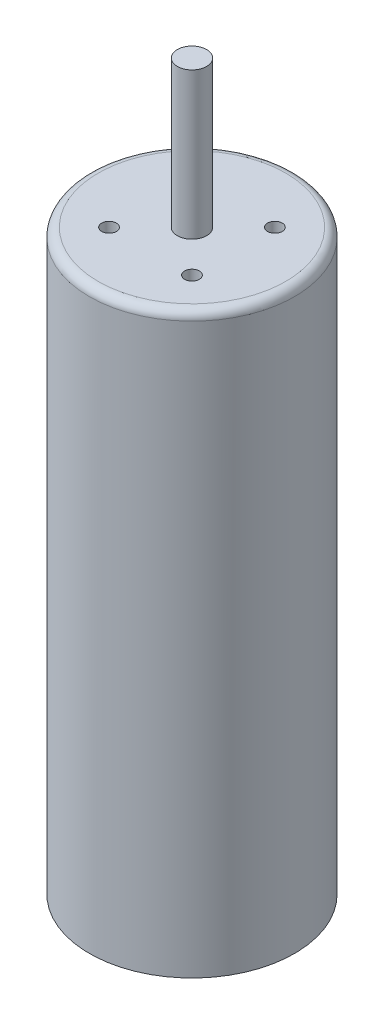
ISO-10303-21;
HEADER;
FILE_DESCRIPTION(('STEP AP214'),'2;1');
FILE_NAME('part.step','',(''),(''),'','','');
FILE_SCHEMA(('AUTOMOTIVE_DESIGN { 1 0 10303 214 1 1 1 1 }'));
ENDSEC;
DATA;
#1=APPLICATION_CONTEXT('core data for automotive mechanical design processes');
#2=APPLICATION_PROTOCOL_DEFINITION('international standard','automotive_design',2000,#1);
#3=PRODUCT_CONTEXT('',#1,'mechanical');
#4=PRODUCT('Part','Part','',(#3));
#5=PRODUCT_RELATED_PRODUCT_CATEGORY('part','',(#4));
#6=PRODUCT_DEFINITION_FORMATION('','',#4);
#7=PRODUCT_DEFINITION_CONTEXT('part definition',#1,'design');
#8=PRODUCT_DEFINITION('design','',#6,#7);
#9=PRODUCT_DEFINITION_SHAPE('','',#8);
#10=(LENGTH_UNIT() NAMED_UNIT(*) SI_UNIT(.MILLI.,.METRE.));
#11=(NAMED_UNIT(*) PLANE_ANGLE_UNIT() SI_UNIT($,.RADIAN.));
#12=(NAMED_UNIT(*) SI_UNIT($,.STERADIAN.) SOLID_ANGLE_UNIT());
#13=UNCERTAINTY_MEASURE_WITH_UNIT(LENGTH_MEASURE(1.E-05),#10,'distance_accuracy_value','');
#14=(GEOMETRIC_REPRESENTATION_CONTEXT(3) GLOBAL_UNCERTAINTY_ASSIGNED_CONTEXT((#13)) GLOBAL_UNIT_ASSIGNED_CONTEXT((#10,
#11,#12)) REPRESENTATION_CONTEXT('',''));
#15=CARTESIAN_POINT('',(0.,0.,0.));
#16=DIRECTION('',(0.,0.,1.));
#17=DIRECTION('',(1.,0.,0.));
#18=AXIS2_PLACEMENT_3D('',#15,#16,#17);
#19=CARTESIAN_POINT('',(0.,20.,0.));
#20=DIRECTION('',(0.,-1.,0.));
#21=DIRECTION('',(0.,0.,-1.));
#22=AXIS2_PLACEMENT_3D('',#19,#20,#21);
#23=CYLINDRICAL_SURFACE('',#22,3.5);
#24=CARTESIAN_POINT('',(0.,19.7,0.));
#25=DIRECTION('',(0.,1.,0.));
#26=DIRECTION('',(0.,0.,1.));
#27=AXIS2_PLACEMENT_3D('',#24,#25,#26);
#28=CIRCLE('',#27,3.5);
#29=CARTESIAN_POINT('',(0.,19.7,3.5));
#30=VERTEX_POINT('',#29);
#31=EDGE_CURVE('E11',#30,#30,#28,.F.);
#32=ORIENTED_EDGE('',*,*,#31,.T.);
#33=EDGE_LOOP('',(#32));
#34=FACE_BOUND('',#33,.T.);
#35=CARTESIAN_POINT('',(0.,0.300000000000002,0.));
#36=DIRECTION('',(0.,-1.,0.));
#37=DIRECTION('',(0.,0.,-1.));
#38=AXIS2_PLACEMENT_3D('',#35,#36,#37);
#39=CIRCLE('',#38,3.5);
#40=CARTESIAN_POINT('',(0.,0.300000000000002,-3.5));
#41=VERTEX_POINT('',#40);
#42=EDGE_CURVE('E38',#41,#41,#39,.T.);
#43=ORIENTED_EDGE('',*,*,#42,.F.);
#44=EDGE_LOOP('',(#43));
#45=FACE_BOUND('',#44,.T.);
#46=ADVANCED_FACE('F34',(#34,#45),#23,.T.);
#47=CARTESIAN_POINT('',(0.,20.,0.));
#48=DIRECTION('',(0.,1.,0.));
#49=DIRECTION('',(0.,0.,1.));
#50=AXIS2_PLACEMENT_3D('',#47,#48,#49);
#51=PLANE('',#50);
#52=CARTESIAN_POINT('',(-1.41421356237301,20.,1.4142135623731));
#53=DIRECTION('',(0.,1.,0.));
#54=DIRECTION('',(0.,0.,1.));
#55=AXIS2_PLACEMENT_3D('',#52,#53,#54);
#56=CIRCLE('',#55,0.250000000000041);
#57=CARTESIAN_POINT('',(-1.41421356237301,20.,1.66421356237314));
#58=VERTEX_POINT('',#57);
#59=EDGE_CURVE('E61',#58,#58,#56,.T.);
#60=ORIENTED_EDGE('',*,*,#59,.F.);
#61=EDGE_LOOP('',(#60));
#62=FACE_BOUND('',#61,.T.);
#63=CARTESIAN_POINT('',(1.41421356237318,20.,1.41421356237301));
#64=DIRECTION('',(0.,1.,0.));
#65=DIRECTION('',(0.,0.,1.));
#66=AXIS2_PLACEMENT_3D('',#63,#64,#65);
#67=CIRCLE('',#66,0.250000000000111);
#68=CARTESIAN_POINT('',(1.41421356237318,20.,1.66421356237312));
#69=VERTEX_POINT('',#68);
#70=EDGE_CURVE('E67',#69,#69,#67,.T.);
#71=ORIENTED_EDGE('',*,*,#70,.F.);
#72=EDGE_LOOP('',(#71));
#73=FACE_BOUND('',#72,.T.);
#74=CARTESIAN_POINT('',(1.41421356237309,20.,-1.41421356237318));
#75=DIRECTION('',(0.,1.,0.));
#76=DIRECTION('',(0.,0.,1.));
#77=AXIS2_PLACEMENT_3D('',#74,#75,#76);
#78=CIRCLE('',#77,0.250000000000081);
#79=CARTESIAN_POINT('',(1.41421356237309,20.,-1.1642135623731));
#80=VERTEX_POINT('',#79);
#81=EDGE_CURVE('E73',#80,#80,#78,.T.);
#82=ORIENTED_EDGE('',*,*,#81,.F.);
#83=EDGE_LOOP('',(#82));
#84=FACE_BOUND('',#83,.T.);
#85=CARTESIAN_POINT('',(-1.4142135623731,20.,-1.41421356237309));
#86=DIRECTION('',(0.,1.,0.));
#87=DIRECTION('',(0.,0.,1.));
#88=AXIS2_PLACEMENT_3D('',#85,#86,#87);
#89=CIRCLE('',#88,0.25);
#90=CARTESIAN_POINT('',(-1.4142135623731,20.,-1.16421356237309));
#91=VERTEX_POINT('',#90);
#92=EDGE_CURVE('E55',#91,#91,#89,.T.);
#93=ORIENTED_EDGE('',*,*,#92,.F.);
#94=EDGE_LOOP('',(#93));
#95=FACE_BOUND('',#94,.T.);
#96=CARTESIAN_POINT('',(0.,20.,0.));
#97=DIRECTION('',(0.,1.,0.));
#98=DIRECTION('',(0.,0.,1.));
#99=AXIS2_PLACEMENT_3D('',#96,#97,#98);
#100=CIRCLE('',#99,3.2);
#101=CARTESIAN_POINT('',(0.,20.,3.2));
#102=VERTEX_POINT('',#101);
#103=EDGE_CURVE('E42',#102,#102,#100,.T.);
#104=ORIENTED_EDGE('',*,*,#103,.T.);
#105=EDGE_LOOP('',(#104));
#106=FACE_BOUND('',#105,.T.);
#107=CARTESIAN_POINT('',(0.,20.,0.));
#108=DIRECTION('',(0.,1.,0.));
#109=DIRECTION('',(0.,0.,1.));
#110=AXIS2_PLACEMENT_3D('',#107,#108,#109);
#111=CIRCLE('',#110,0.5);
#112=CARTESIAN_POINT('',(0.,20.,0.5));
#113=VERTEX_POINT('',#112);
#114=EDGE_CURVE('E49',#113,#113,#111,.T.);
#115=ORIENTED_EDGE('',*,*,#114,.F.);
#116=EDGE_LOOP('',(#115));
#117=FACE_BOUND('',#116,.T.);
#118=ADVANCED_FACE('F117',(#62,#73,#84,#95,#106,#117),#51,.T.);
#119=CARTESIAN_POINT('',(0.,25.,0.));
#120=DIRECTION('',(0.,-1.,0.));
#121=DIRECTION('',(0.,0.,-1.));
#122=AXIS2_PLACEMENT_3D('',#119,#120,#121);
#123=CYLINDRICAL_SURFACE('',#122,0.5);
#124=CARTESIAN_POINT('',(0.,25.,0.));
#125=DIRECTION('',(0.,1.,0.));
#126=DIRECTION('',(0.,0.,1.));
#127=AXIS2_PLACEMENT_3D('',#124,#125,#126);
#128=CIRCLE('',#127,0.5);
#129=CARTESIAN_POINT('',(0.,25.,0.5));
#130=VERTEX_POINT('',#129);
#131=EDGE_CURVE('E46',#130,#130,#128,.T.);
#132=ORIENTED_EDGE('',*,*,#131,.F.);
#133=EDGE_LOOP('',(#132));
#134=FACE_BOUND('',#133,.T.);
#135=ORIENTED_EDGE('',*,*,#114,.T.);
#136=EDGE_LOOP('',(#135));
#137=FACE_BOUND('',#136,.T.);
#138=ADVANCED_FACE('F123',(#134,#137),#123,.T.);
#139=CARTESIAN_POINT('',(0.,25.,0.));
#140=DIRECTION('',(0.,1.,0.));
#141=DIRECTION('',(0.,0.,1.));
#142=AXIS2_PLACEMENT_3D('',#139,#140,#141);
#143=PLANE('',#142);
#144=ORIENTED_EDGE('',*,*,#131,.T.);
#145=EDGE_LOOP('',(#144));
#146=FACE_BOUND('',#145,.T.);
#147=ADVANCED_FACE('F130',(#146),#143,.T.);
#148=CARTESIAN_POINT('',(0.,19.7,0.));
#149=DIRECTION('',(0.,1.,0.));
#150=DIRECTION('',(0.,0.,1.));
#151=AXIS2_PLACEMENT_3D('',#148,#149,#150);
#152=TOROIDAL_SURFACE('',#151,3.2,0.3);
#153=ORIENTED_EDGE('',*,*,#31,.F.);
#154=EDGE_LOOP('',(#153));
#155=FACE_BOUND('',#154,.T.);
#156=ORIENTED_EDGE('',*,*,#103,.F.);
#157=EDGE_LOOP('',(#156));
#158=FACE_BOUND('',#157,.T.);
#159=ADVANCED_FACE('F36',(#155,#158),#152,.T.);
#160=CARTESIAN_POINT('',(-1.4142135623731,15.,-1.41421356237309));
#161=DIRECTION('',(0.,1.,0.));
#162=DIRECTION('',(0.,0.,1.));
#163=AXIS2_PLACEMENT_3D('',#160,#161,#162);
#164=CYLINDRICAL_SURFACE('',#163,0.25);
#165=CARTESIAN_POINT('',(-1.4142135623731,15.,-1.41421356237309));
#166=DIRECTION('',(0.,1.,0.));
#167=DIRECTION('',(0.,0.,1.));
#168=AXIS2_PLACEMENT_3D('',#165,#166,#167);
#169=CIRCLE('',#168,0.25);
#170=CARTESIAN_POINT('',(-1.4142135623731,15.,-1.16421356237309));
#171=VERTEX_POINT('',#170);
#172=EDGE_CURVE('E52',#171,#171,#169,.T.);
#173=ORIENTED_EDGE('',*,*,#172,.F.);
#174=EDGE_LOOP('',(#173));
#175=FACE_BOUND('',#174,.T.);
#176=ORIENTED_EDGE('',*,*,#92,.T.);
#177=EDGE_LOOP('',(#176));
#178=FACE_BOUND('',#177,.T.);
#179=ADVANCED_FACE('F135',(#175,#178),#164,.F.);
#180=CARTESIAN_POINT('',(-1.4142135623731,15.,-1.41421356237309));
#181=DIRECTION('',(0.,1.,0.));
#182=DIRECTION('',(0.,0.,1.));
#183=AXIS2_PLACEMENT_3D('',#180,#181,#182);
#184=PLANE('',#183);
#185=ORIENTED_EDGE('',*,*,#172,.T.);
#186=EDGE_LOOP('',(#185));
#187=FACE_BOUND('',#186,.T.);
#188=ADVANCED_FACE('F138',(#187),#184,.T.);
#189=CARTESIAN_POINT('',(1.41421356237309,15.,-1.41421356237318));
#190=DIRECTION('',(0.,1.,0.));
#191=DIRECTION('',(0.,0.,1.));
#192=AXIS2_PLACEMENT_3D('',#189,#190,#191);
#193=CYLINDRICAL_SURFACE('',#192,0.250000000000081);
#194=CARTESIAN_POINT('',(1.41421356237309,15.,-1.41421356237318));
#195=DIRECTION('',(0.,1.,0.));
#196=DIRECTION('',(0.,0.,1.));
#197=AXIS2_PLACEMENT_3D('',#194,#195,#196);
#198=CIRCLE('',#197,0.250000000000081);
#199=CARTESIAN_POINT('',(1.41421356237309,15.,-1.1642135623731));
#200=VERTEX_POINT('',#199);
#201=EDGE_CURVE('E58',#200,#200,#198,.T.);
#202=ORIENTED_EDGE('',*,*,#201,.F.);
#203=EDGE_LOOP('',(#202));
#204=FACE_BOUND('',#203,.T.);
#205=ORIENTED_EDGE('',*,*,#81,.T.);
#206=EDGE_LOOP('',(#205));
#207=FACE_BOUND('',#206,.T.);
#208=ADVANCED_FACE('F142',(#204,#207),#193,.F.);
#209=CARTESIAN_POINT('',(1.41421356237309,15.,-1.41421356237318));
#210=DIRECTION('',(0.,1.,0.));
#211=DIRECTION('',(0.,0.,1.));
#212=AXIS2_PLACEMENT_3D('',#209,#210,#211);
#213=PLANE('',#212);
#214=ORIENTED_EDGE('',*,*,#201,.T.);
#215=EDGE_LOOP('',(#214));
#216=FACE_BOUND('',#215,.T.);
#217=ADVANCED_FACE('F155',(#216),#213,.T.);
#218=CARTESIAN_POINT('',(1.41421356237318,15.,1.41421356237301));
#219=DIRECTION('',(0.,1.,0.));
#220=DIRECTION('',(0.,0.,1.));
#221=AXIS2_PLACEMENT_3D('',#218,#219,#220);
#222=CYLINDRICAL_SURFACE('',#221,0.250000000000111);
#223=CARTESIAN_POINT('',(1.41421356237318,15.,1.41421356237301));
#224=DIRECTION('',(0.,1.,0.));
#225=DIRECTION('',(0.,0.,1.));
#226=AXIS2_PLACEMENT_3D('',#223,#224,#225);
#227=CIRCLE('',#226,0.250000000000111);
#228=CARTESIAN_POINT('',(1.41421356237318,15.,1.66421356237312));
#229=VERTEX_POINT('',#228);
#230=EDGE_CURVE('E70',#229,#229,#227,.T.);
#231=ORIENTED_EDGE('',*,*,#230,.F.);
#232=EDGE_LOOP('',(#231));
#233=FACE_BOUND('',#232,.T.);
#234=ORIENTED_EDGE('',*,*,#70,.T.);
#235=EDGE_LOOP('',(#234));
#236=FACE_BOUND('',#235,.T.);
#237=ADVANCED_FACE('F152',(#233,#236),#222,.F.);
#238=CARTESIAN_POINT('',(1.41421356237318,15.,1.41421356237301));
#239=DIRECTION('',(0.,1.,0.));
#240=DIRECTION('',(0.,0.,1.));
#241=AXIS2_PLACEMENT_3D('',#238,#239,#240);
#242=PLANE('',#241);
#243=ORIENTED_EDGE('',*,*,#230,.T.);
#244=EDGE_LOOP('',(#243));
#245=FACE_BOUND('',#244,.T.);
#246=ADVANCED_FACE('F147',(#245),#242,.T.);
#247=CARTESIAN_POINT('',(-1.41421356237301,15.,1.4142135623731));
#248=DIRECTION('',(0.,1.,0.));
#249=DIRECTION('',(0.,0.,1.));
#250=AXIS2_PLACEMENT_3D('',#247,#248,#249);
#251=CYLINDRICAL_SURFACE('',#250,0.250000000000041);
#252=CARTESIAN_POINT('',(-1.41421356237301,15.,1.4142135623731));
#253=DIRECTION('',(0.,1.,0.));
#254=DIRECTION('',(0.,0.,1.));
#255=AXIS2_PLACEMENT_3D('',#252,#253,#254);
#256=CIRCLE('',#255,0.250000000000041);
#257=CARTESIAN_POINT('',(-1.41421356237301,15.,1.66421356237314));
#258=VERTEX_POINT('',#257);
#259=EDGE_CURVE('E64',#258,#258,#256,.T.);
#260=ORIENTED_EDGE('',*,*,#259,.F.);
#261=EDGE_LOOP('',(#260));
#262=FACE_BOUND('',#261,.T.);
#263=ORIENTED_EDGE('',*,*,#59,.T.);
#264=EDGE_LOOP('',(#263));
#265=FACE_BOUND('',#264,.T.);
#266=ADVANCED_FACE('F144',(#262,#265),#251,.F.);
#267=CARTESIAN_POINT('',(-1.41421356237301,15.,1.4142135623731));
#268=DIRECTION('',(0.,1.,0.));
#269=DIRECTION('',(0.,0.,1.));
#270=AXIS2_PLACEMENT_3D('',#267,#268,#269);
#271=PLANE('',#270);
#272=ORIENTED_EDGE('',*,*,#259,.T.);
#273=EDGE_LOOP('',(#272));
#274=FACE_BOUND('',#273,.T.);
#275=ADVANCED_FACE('F113',(#274),#271,.T.);
#276=CARTESIAN_POINT('',(0.,0.3,0.));
#277=DIRECTION('',(0.,-1.,0.));
#278=DIRECTION('',(0.,0.,-1.));
#279=AXIS2_PLACEMENT_3D('',#276,#277,#278);
#280=PLANE('',#279);
#281=CARTESIAN_POINT('',(0.,0.3,0.));
#282=DIRECTION('',(0.,-1.,0.));
#283=DIRECTION('',(0.,0.,-1.));
#284=AXIS2_PLACEMENT_3D('',#281,#282,#283);
#285=CIRCLE('',#284,3.);
#286=CARTESIAN_POINT('',(0.,0.3,-3.));
#287=VERTEX_POINT('',#286);
#288=EDGE_CURVE('E81',#287,#287,#285,.T.);
#289=ORIENTED_EDGE('',*,*,#288,.F.);
#290=EDGE_LOOP('',(#289));
#291=FACE_BOUND('',#290,.T.);
#292=ORIENTED_EDGE('',*,*,#42,.T.);
#293=EDGE_LOOP('',(#292));
#294=FACE_BOUND('',#293,.T.);
#295=ADVANCED_FACE('F107',(#291,#294),#280,.T.);
#296=CARTESIAN_POINT('',(0.,0.3,0.));
#297=DIRECTION('',(0.,-1.,0.));
#298=DIRECTION('',(0.,0.,-1.));
#299=AXIS2_PLACEMENT_3D('',#296,#297,#298);
#300=CYLINDRICAL_SURFACE('',#299,3.);
#301=ORIENTED_EDGE('',*,*,#288,.T.);
#302=EDGE_LOOP('',(#301));
#303=FACE_BOUND('',#302,.T.);
#304=CARTESIAN_POINT('',(0.,0.,0.));
#305=DIRECTION('',(0.,-1.,0.));
#306=DIRECTION('',(0.,0.,-1.));
#307=AXIS2_PLACEMENT_3D('',#304,#305,#306);
#308=CIRCLE('',#307,3.);
#309=CARTESIAN_POINT('',(0.,0.,-3.));
#310=VERTEX_POINT('',#309);
#311=EDGE_CURVE('E78',#310,#310,#308,.T.);
#312=ORIENTED_EDGE('',*,*,#311,.F.);
#313=EDGE_LOOP('',(#312));
#314=FACE_BOUND('',#313,.T.);
#315=ADVANCED_FACE('F102',(#303,#314),#300,.T.);
#316=CARTESIAN_POINT('',(0.,0.,0.));
#317=DIRECTION('',(0.,1.,0.));
#318=DIRECTION('',(0.,0.,1.));
#319=AXIS2_PLACEMENT_3D('',#316,#317,#318);
#320=PLANE('',#319);
#321=CARTESIAN_POINT('',(0.,0.,0.));
#322=DIRECTION('',(0.,-1.,0.));
#323=DIRECTION('',(0.,0.,-1.));
#324=AXIS2_PLACEMENT_3D('',#321,#322,#323);
#325=CIRCLE('',#324,0.5);
#326=CARTESIAN_POINT('',(0.,0.,-0.5));
#327=VERTEX_POINT('',#326);
#328=EDGE_CURVE('E85',#327,#327,#325,.T.);
#329=ORIENTED_EDGE('',*,*,#328,.F.);
#330=EDGE_LOOP('',(#329));
#331=FACE_BOUND('',#330,.T.);
#332=ORIENTED_EDGE('',*,*,#311,.T.);
#333=EDGE_LOOP('',(#332));
#334=FACE_BOUND('',#333,.T.);
#335=ADVANCED_FACE('F96',(#331,#334),#320,.F.);
#336=CARTESIAN_POINT('',(0.,0.3,0.));
#337=DIRECTION('',(0.,-1.,0.));
#338=DIRECTION('',(0.,0.,-1.));
#339=AXIS2_PLACEMENT_3D('',#336,#337,#338);
#340=CYLINDRICAL_SURFACE('',#339,0.5);
#341=CARTESIAN_POINT('',(0.,0.3,0.));
#342=DIRECTION('',(0.,-1.,0.));
#343=DIRECTION('',(0.,0.,-1.));
#344=AXIS2_PLACEMENT_3D('',#341,#342,#343);
#345=CIRCLE('',#344,0.5);
#346=CARTESIAN_POINT('',(0.,0.3,-0.5));
#347=VERTEX_POINT('',#346);
#348=EDGE_CURVE('E82',#347,#347,#345,.T.);
#349=ORIENTED_EDGE('',*,*,#348,.F.);
#350=EDGE_LOOP('',(#349));
#351=FACE_BOUND('',#350,.T.);
#352=ORIENTED_EDGE('',*,*,#328,.T.);
#353=EDGE_LOOP('',(#352));
#354=FACE_BOUND('',#353,.T.);
#355=ADVANCED_FACE('F93',(#351,#354),#340,.F.);
#356=CARTESIAN_POINT('',(0.,0.3,0.));
#357=DIRECTION('',(0.,-1.,0.));
#358=DIRECTION('',(0.,0.,-1.));
#359=AXIS2_PLACEMENT_3D('',#356,#357,#358);
#360=PLANE('',#359);
#361=ORIENTED_EDGE('',*,*,#348,.T.);
#362=EDGE_LOOP('',(#361));
#363=FACE_BOUND('',#362,.T.);
#364=ADVANCED_FACE('F91',(#363),#360,.T.);
#365=CLOSED_SHELL('',(#46,#118,#138,#147,#159,#179,#188,#208,#217,#237,#246,#266,#275,#295,#315,
#335,#355,#364));
#366=MANIFOLD_SOLID_BREP('B2',#365);
#367=ADVANCED_BREP_SHAPE_REPRESENTATION('',(#18,#366),#14);
#368=SHAPE_DEFINITION_REPRESENTATION(#9,#367);
ENDSEC;
END-ISO-10303-21;
